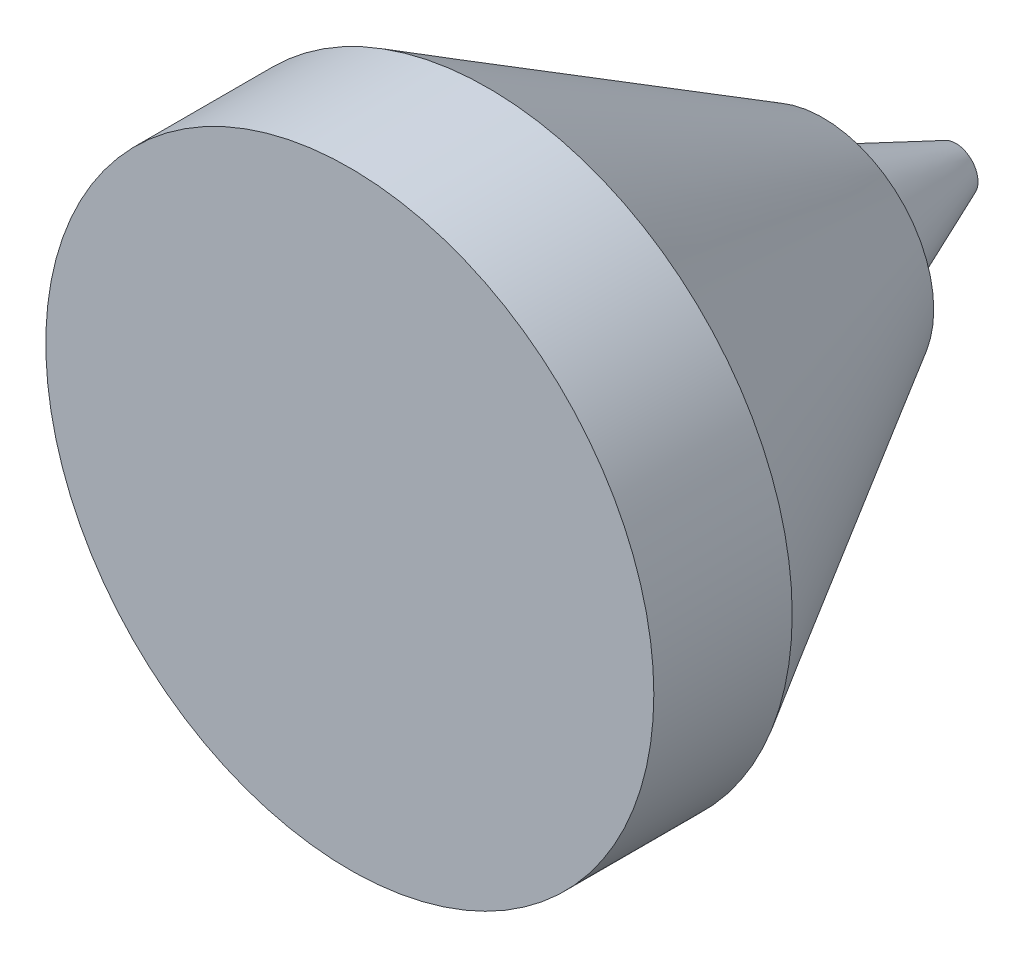
ISO-10303-21;
HEADER;
FILE_DESCRIPTION(('STEP AP214'),'2;1');
FILE_NAME('part.step','',(''),(''),'','','');
FILE_SCHEMA(('AUTOMOTIVE_DESIGN { 1 0 10303 214 1 1 1 1 }'));
ENDSEC;
DATA;
#1=APPLICATION_CONTEXT('core data for automotive mechanical design processes');
#2=APPLICATION_PROTOCOL_DEFINITION('international standard','automotive_design',2000,#1);
#3=PRODUCT_CONTEXT('',#1,'mechanical');
#4=PRODUCT('Part','Part','',(#3));
#5=PRODUCT_RELATED_PRODUCT_CATEGORY('part','',(#4));
#6=PRODUCT_DEFINITION_FORMATION('','',#4);
#7=PRODUCT_DEFINITION_CONTEXT('part definition',#1,'design');
#8=PRODUCT_DEFINITION('design','',#6,#7);
#9=PRODUCT_DEFINITION_SHAPE('','',#8);
#10=(LENGTH_UNIT() NAMED_UNIT(*) SI_UNIT(.MILLI.,.METRE.));
#11=(NAMED_UNIT(*) PLANE_ANGLE_UNIT() SI_UNIT($,.RADIAN.));
#12=(NAMED_UNIT(*) SI_UNIT($,.STERADIAN.) SOLID_ANGLE_UNIT());
#13=UNCERTAINTY_MEASURE_WITH_UNIT(LENGTH_MEASURE(1.E-05),#10,'distance_accuracy_value','');
#14=(GEOMETRIC_REPRESENTATION_CONTEXT(3) GLOBAL_UNCERTAINTY_ASSIGNED_CONTEXT((#13)) GLOBAL_UNIT_ASSIGNED_CONTEXT((#10,
#11,#12)) REPRESENTATION_CONTEXT('',''));
#15=CARTESIAN_POINT('',(0.,0.,0.));
#16=DIRECTION('',(0.,0.,1.));
#17=DIRECTION('',(1.,0.,0.));
#18=AXIS2_PLACEMENT_3D('',#15,#16,#17);
#19=CARTESIAN_POINT('',(0.,10.9859382571945,35.55));
#20=DIRECTION('',(0.,0.,-1.));
#21=DIRECTION('',(-1.,0.,0.));
#22=AXIS2_PLACEMENT_3D('',#19,#20,#21);
#23=PLANE('',#22);
#24=CARTESIAN_POINT('',(0.,0.,35.55));
#25=DIRECTION('',(0.,0.,1.));
#26=DIRECTION('',(1.,0.,0.));
#27=AXIS2_PLACEMENT_3D('',#24,#25,#26);
#28=CIRCLE('',#27,10.9859382571945);
#29=CARTESIAN_POINT('',(10.9859382571945,0.,35.55));
#30=VERTEX_POINT('',#29);
#31=EDGE_CURVE('E34',#30,#30,#28,.T.);
#32=ORIENTED_EDGE('',*,*,#31,.T.);
#33=EDGE_LOOP('',(#32));
#34=FACE_BOUND('',#33,.T.);
#35=ADVANCED_FACE('F31',(#34),#23,.F.);
#36=CARTESIAN_POINT('',(0.,0.,35.55));
#37=DIRECTION('',(0.,0.,1.));
#38=DIRECTION('',(1.,0.,0.));
#39=AXIS2_PLACEMENT_3D('',#36,#37,#38);
#40=CYLINDRICAL_SURFACE('',#39,10.9859382571945);
#41=ORIENTED_EDGE('',*,*,#31,.F.);
#42=EDGE_LOOP('',(#41));
#43=FACE_BOUND('',#42,.T.);
#44=CARTESIAN_POINT('',(0.,0.,30.55));
#45=DIRECTION('',(0.,0.,1.));
#46=DIRECTION('',(1.,0.,0.));
#47=AXIS2_PLACEMENT_3D('',#44,#45,#46);
#48=CIRCLE('',#47,10.9859382571945);
#49=CARTESIAN_POINT('',(10.9859382571945,0.,30.55));
#50=VERTEX_POINT('',#49);
#51=EDGE_CURVE('E42',#50,#50,#48,.T.);
#52=ORIENTED_EDGE('',*,*,#51,.T.);
#53=EDGE_LOOP('',(#52));
#54=FACE_BOUND('',#53,.T.);
#55=ADVANCED_FACE('F51',(#43,#54),#40,.T.);
#56=CARTESIAN_POINT('',(0.,0.,18.45));
#57=DIRECTION('',(0.,0.,1.));
#58=DIRECTION('',(1.,0.,0.));
#59=AXIS2_PLACEMENT_3D('',#56,#57,#58);
#60=CONICAL_SURFACE('',#59,4.,0.5235987755983);
#61=ORIENTED_EDGE('',*,*,#51,.F.);
#62=EDGE_LOOP('',(#61));
#63=FACE_BOUND('',#62,.T.);
#64=CARTESIAN_POINT('',(0.,0.,18.45));
#65=DIRECTION('',(0.,0.,1.));
#66=DIRECTION('',(1.,0.,0.));
#67=AXIS2_PLACEMENT_3D('',#64,#65,#66);
#68=CIRCLE('',#67,4.);
#69=CARTESIAN_POINT('',(4.,0.,18.45));
#70=VERTEX_POINT('',#69);
#71=EDGE_CURVE('E46',#70,#70,#68,.T.);
#72=ORIENTED_EDGE('',*,*,#71,.T.);
#73=EDGE_LOOP('',(#72));
#74=FACE_BOUND('',#73,.T.);
#75=ADVANCED_FACE('F53',(#63,#74),#60,.T.);
#76=CARTESIAN_POINT('',(0.,0.,18.45));
#77=DIRECTION('',(0.,0.,1.));
#78=DIRECTION('',(1.,0.,0.));
#79=AXIS2_PLACEMENT_3D('',#76,#77,#78);
#80=PLANE('',#79);
#81=CARTESIAN_POINT('',(0.,0.,18.45));
#82=DIRECTION('',(0.,0.,-1.));
#83=DIRECTION('',(0.,1.,0.));
#84=AXIS2_PLACEMENT_3D('',#81,#82,#83);
#85=CIRCLE('',#84,2.8);
#86=CARTESIAN_POINT('',(0.,2.8,18.45));
#87=VERTEX_POINT('',#86);
#88=EDGE_CURVE('E10',#87,#87,#85,.T.);
#89=ORIENTED_EDGE('',*,*,#88,.F.);
#90=EDGE_LOOP('',(#89));
#91=FACE_BOUND('',#90,.T.);
#92=ORIENTED_EDGE('',*,*,#71,.F.);
#93=EDGE_LOOP('',(#92));
#94=FACE_BOUND('',#93,.T.);
#95=ADVANCED_FACE('F56',(#91,#94),#80,.F.);
#96=CARTESIAN_POINT('',(0.,0.,13.65));
#97=DIRECTION('',(0.,0.,1.));
#98=DIRECTION('',(0.,-1.,0.));
#99=AXIS2_PLACEMENT_3D('',#96,#97,#98);
#100=CONICAL_SURFACE('',#99,0.8,0.394791119699762);
#101=ORIENTED_EDGE('',*,*,#88,.T.);
#102=EDGE_LOOP('',(#101));
#103=FACE_BOUND('',#102,.T.);
#104=CARTESIAN_POINT('',(0.,0.,13.65));
#105=DIRECTION('',(0.,0.,-1.));
#106=DIRECTION('',(0.,1.,0.));
#107=AXIS2_PLACEMENT_3D('',#104,#105,#106);
#108=CIRCLE('',#107,0.8);
#109=CARTESIAN_POINT('',(0.,0.8,13.65));
#110=VERTEX_POINT('',#109);
#111=EDGE_CURVE('E45',#110,#110,#108,.T.);
#112=ORIENTED_EDGE('',*,*,#111,.F.);
#113=EDGE_LOOP('',(#112));
#114=FACE_BOUND('',#113,.T.);
#115=ADVANCED_FACE('F61',(#103,#114),#100,.T.);
#116=CARTESIAN_POINT('',(0.,0.8,13.65));
#117=DIRECTION('',(0.,0.,-1.));
#118=DIRECTION('',(0.,1.,0.));
#119=AXIS2_PLACEMENT_3D('',#116,#117,#118);
#120=PLANE('',#119);
#121=ORIENTED_EDGE('',*,*,#111,.T.);
#122=EDGE_LOOP('',(#121));
#123=FACE_BOUND('',#122,.T.);
#124=ADVANCED_FACE('F67',(#123),#120,.T.);
#125=CLOSED_SHELL('',(#35,#55,#75,#95,#115,#124));
#126=MANIFOLD_SOLID_BREP('B2',#125);
#127=ADVANCED_BREP_SHAPE_REPRESENTATION('',(#18,#126),#14);
#128=SHAPE_DEFINITION_REPRESENTATION(#9,#127);
ENDSEC;
END-ISO-10303-21;
